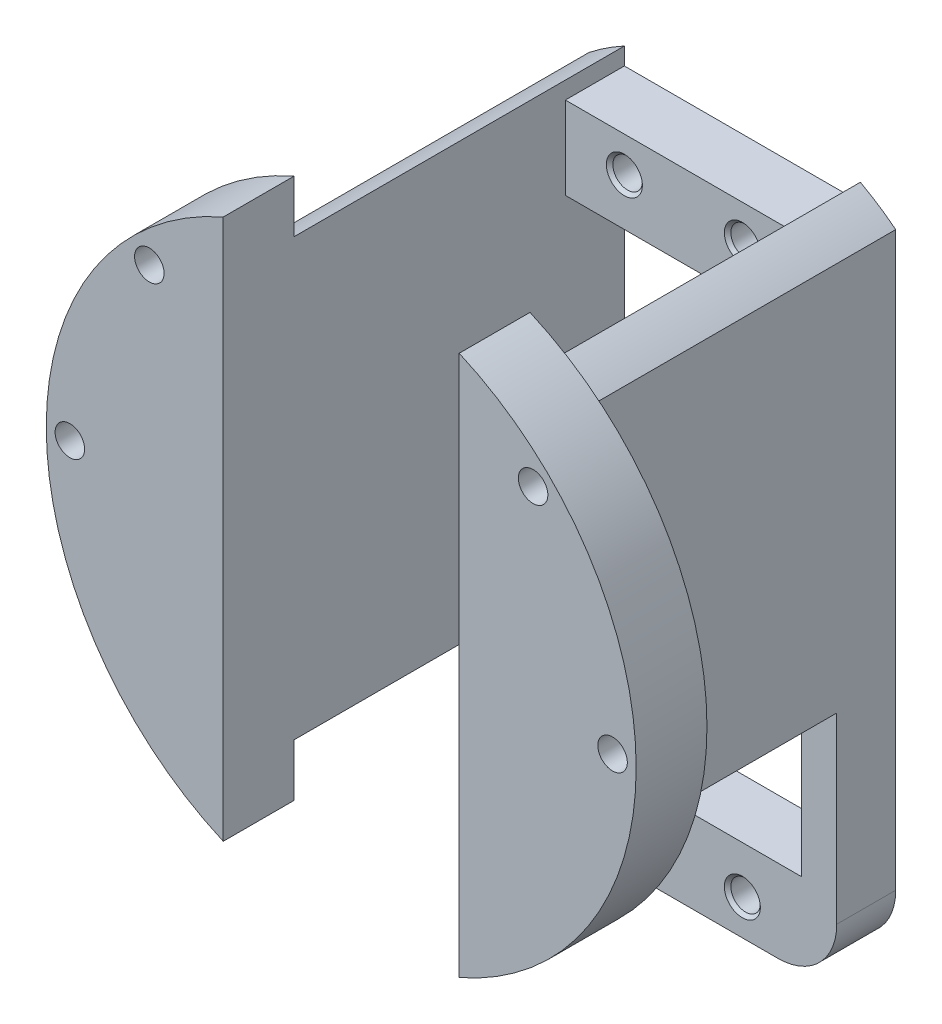
ISO-10303-21;
HEADER;
FILE_DESCRIPTION(('STEP AP214'),'2;1');
FILE_NAME('part.step','',(''),(''),'','','');
FILE_SCHEMA(('AUTOMOTIVE_DESIGN { 1 0 10303 214 1 1 1 1 }'));
ENDSEC;
DATA;
#1=APPLICATION_CONTEXT('core data for automotive mechanical design processes');
#2=APPLICATION_PROTOCOL_DEFINITION('international standard','automotive_design',2000,#1);
#3=PRODUCT_CONTEXT('',#1,'mechanical');
#4=PRODUCT('Part','Part','',(#3));
#5=PRODUCT_RELATED_PRODUCT_CATEGORY('part','',(#4));
#6=PRODUCT_DEFINITION_FORMATION('','',#4);
#7=PRODUCT_DEFINITION_CONTEXT('part definition',#1,'design');
#8=PRODUCT_DEFINITION('design','',#6,#7);
#9=PRODUCT_DEFINITION_SHAPE('','',#8);
#10=(LENGTH_UNIT() NAMED_UNIT(*) SI_UNIT(.MILLI.,.METRE.));
#11=(NAMED_UNIT(*) PLANE_ANGLE_UNIT() SI_UNIT($,.RADIAN.));
#12=(NAMED_UNIT(*) SI_UNIT($,.STERADIAN.) SOLID_ANGLE_UNIT());
#13=UNCERTAINTY_MEASURE_WITH_UNIT(LENGTH_MEASURE(1.E-05),#10,'distance_accuracy_value','');
#14=(GEOMETRIC_REPRESENTATION_CONTEXT(3) GLOBAL_UNCERTAINTY_ASSIGNED_CONTEXT((#13)) GLOBAL_UNIT_ASSIGNED_CONTEXT((#10,
#11,#12)) REPRESENTATION_CONTEXT('',''));
#15=CARTESIAN_POINT('',(0.,0.,0.));
#16=DIRECTION('',(0.,0.,1.));
#17=DIRECTION('',(1.,0.,0.));
#18=AXIS2_PLACEMENT_3D('',#15,#16,#17);
#19=CARTESIAN_POINT('',(0.,0.,0.));
#20=DIRECTION('',(0.,0.,-1.));
#21=DIRECTION('',(-1.,0.,0.));
#22=AXIS2_PLACEMENT_3D('',#19,#20,#21);
#23=PLANE('',#22);
#24=CARTESIAN_POINT('',(5.00000000000001,-34.,0.));
#25=DIRECTION('',(0.,0.,1.));
#26=DIRECTION('',(1.,0.,0.));
#27=AXIS2_PLACEMENT_3D('',#24,#25,#26);
#28=CIRCLE('',#27,1.25);
#29=CARTESIAN_POINT('',(6.25000000000001,-34.,0.));
#30=VERTEX_POINT('',#29);
#31=EDGE_CURVE('E732',#30,#30,#28,.T.);
#32=ORIENTED_EDGE('',*,*,#31,.T.);
#33=EDGE_LOOP('',(#32));
#34=FACE_BOUND('',#33,.T.);
#35=CARTESIAN_POINT('',(5.,14.,0.));
#36=DIRECTION('',(0.,0.,1.));
#37=DIRECTION('',(1.,0.,0.));
#38=AXIS2_PLACEMENT_3D('',#35,#36,#37);
#39=CIRCLE('',#38,1.25);
#40=CARTESIAN_POINT('',(6.25,14.,0.));
#41=VERTEX_POINT('',#40);
#42=EDGE_CURVE('E723',#41,#41,#39,.T.);
#43=ORIENTED_EDGE('',*,*,#42,.T.);
#44=EDGE_LOOP('',(#43));
#45=FACE_BOUND('',#44,.T.);
#46=CARTESIAN_POINT('',(-4.99999999999999,-34.,0.));
#47=DIRECTION('',(0.,0.,1.));
#48=DIRECTION('',(1.,0.,0.));
#49=AXIS2_PLACEMENT_3D('',#46,#47,#48);
#50=CIRCLE('',#49,1.25);
#51=CARTESIAN_POINT('',(-3.74999999999999,-34.,0.));
#52=VERTEX_POINT('',#51);
#53=EDGE_CURVE('E714',#52,#52,#50,.T.);
#54=ORIENTED_EDGE('',*,*,#53,.T.);
#55=EDGE_LOOP('',(#54));
#56=FACE_BOUND('',#55,.T.);
#57=CARTESIAN_POINT('',(-5.,14.,0.));
#58=DIRECTION('',(0.,0.,1.));
#59=DIRECTION('',(1.,0.,0.));
#60=AXIS2_PLACEMENT_3D('',#57,#58,#59);
#61=CIRCLE('',#60,1.25);
#62=CARTESIAN_POINT('',(-3.75,14.,0.));
#63=VERTEX_POINT('',#62);
#64=EDGE_CURVE('E703',#63,#63,#61,.T.);
#65=ORIENTED_EDGE('',*,*,#64,.T.);
#66=EDGE_LOOP('',(#65));
#67=FACE_BOUND('',#66,.T.);
#68=DIRECTION('',(0.,-1.,0.));
#69=VECTOR('',#68,1.);
#70=CARTESIAN_POINT('',(-10.,-30.,0.));
#71=LINE('',#70,#69);
#72=CARTESIAN_POINT('',(-10.,10.,0.));
#73=VERTEX_POINT('',#72);
#74=CARTESIAN_POINT('',(-10.,-30.,0.));
#75=VERTEX_POINT('',#74);
#76=EDGE_CURVE('E302',#73,#75,#71,.T.);
#77=ORIENTED_EDGE('',*,*,#76,.T.);
#78=DIRECTION('',(1.,0.,0.));
#79=VECTOR('',#78,1.);
#80=CARTESIAN_POINT('',(10.,-30.,0.));
#81=LINE('',#80,#79);
#82=CARTESIAN_POINT('',(10.,-30.,0.));
#83=VERTEX_POINT('',#82);
#84=EDGE_CURVE('E316',#75,#83,#81,.T.);
#85=ORIENTED_EDGE('',*,*,#84,.T.);
#86=DIRECTION('',(0.,1.,0.));
#87=VECTOR('',#86,1.);
#88=CARTESIAN_POINT('',(10.,10.,0.));
#89=LINE('',#88,#87);
#90=CARTESIAN_POINT('',(10.,10.,0.));
#91=VERTEX_POINT('',#90);
#92=EDGE_CURVE('E319',#83,#91,#89,.T.);
#93=ORIENTED_EDGE('',*,*,#92,.T.);
#94=DIRECTION('',(-1.,0.,0.));
#95=VECTOR('',#94,1.);
#96=CARTESIAN_POINT('',(-10.,10.,0.));
#97=LINE('',#96,#95);
#98=EDGE_CURVE('E306',#91,#73,#97,.T.);
#99=ORIENTED_EDGE('',*,*,#98,.T.);
#100=EDGE_LOOP('',(#77,#85,#93,#99));
#101=FACE_BOUND('',#100,.T.);
#102=DIRECTION('',(1.,0.,0.));
#103=VECTOR('',#102,1.);
#104=CARTESIAN_POINT('',(13.,-37.,0.));
#105=LINE('',#104,#103);
#106=CARTESIAN_POINT('',(-7.99999999999999,-37.,0.));
#107=VERTEX_POINT('',#106);
#108=CARTESIAN_POINT('',(8.00000000000001,-37.,0.));
#109=VERTEX_POINT('',#108);
#110=EDGE_CURVE('E346',#107,#109,#105,.T.);
#111=ORIENTED_EDGE('',*,*,#110,.F.);
#112=CARTESIAN_POINT('',(-8.,-32.,0.));
#113=DIRECTION('',(0.,0.,-1.));
#114=DIRECTION('',(-1.,0.,0.));
#115=AXIS2_PLACEMENT_3D('',#112,#113,#114);
#116=CIRCLE('',#115,5.);
#117=CARTESIAN_POINT('',(-13.,-32.,0.));
#118=VERTEX_POINT('',#117);
#119=EDGE_CURVE('E358',#107,#118,#116,.T.);
#120=ORIENTED_EDGE('',*,*,#119,.T.);
#121=DIRECTION('',(0.,-1.,0.));
#122=VECTOR('',#121,1.);
#123=CARTESIAN_POINT('',(-13.,-37.,0.));
#124=LINE('',#123,#122);
#125=CARTESIAN_POINT('',(-13.,16.4924225024706,0.));
#126=VERTEX_POINT('',#125);
#127=EDGE_CURVE('E333',#126,#118,#124,.T.);
#128=ORIENTED_EDGE('',*,*,#127,.F.);
#129=CARTESIAN_POINT('',(0.,0.,0.));
#130=DIRECTION('',(0.,0.,1.));
#131=DIRECTION('',(1.,0.,0.));
#132=AXIS2_PLACEMENT_3D('',#129,#130,#131);
#133=CIRCLE('',#132,21.);
#134=CARTESIAN_POINT('',(-10.,18.4661853126194,0.));
#135=VERTEX_POINT('',#134);
#136=EDGE_CURVE('E238',#135,#126,#133,.T.);
#137=ORIENTED_EDGE('',*,*,#136,.F.);
#138=DIRECTION('',(0.,1.,0.));
#139=VECTOR('',#138,1.);
#140=CARTESIAN_POINT('',(-10.,-18.4661853126194,0.));
#141=LINE('',#140,#139);
#142=CARTESIAN_POINT('',(-10.,17.,0.));
#143=VERTEX_POINT('',#142);
#144=EDGE_CURVE('E233',#143,#135,#141,.T.);
#145=ORIENTED_EDGE('',*,*,#144,.F.);
#146=DIRECTION('',(-1.,0.,0.));
#147=VECTOR('',#146,1.);
#148=CARTESIAN_POINT('',(-13.,17.,0.));
#149=LINE('',#148,#147);
#150=CARTESIAN_POINT('',(10.,17.,0.));
#151=VERTEX_POINT('',#150);
#152=EDGE_CURVE('E337',#151,#143,#149,.T.);
#153=ORIENTED_EDGE('',*,*,#152,.F.);
#154=DIRECTION('',(0.,-1.,0.));
#155=VECTOR('',#154,1.);
#156=CARTESIAN_POINT('',(10.,-18.4661853126194,0.));
#157=LINE('',#156,#155);
#158=CARTESIAN_POINT('',(10.,18.4661853126194,0.));
#159=VERTEX_POINT('',#158);
#160=EDGE_CURVE('E272',#159,#151,#157,.T.);
#161=ORIENTED_EDGE('',*,*,#160,.F.);
#162=CARTESIAN_POINT('',(0.,0.,0.));
#163=DIRECTION('',(0.,0.,1.));
#164=DIRECTION('',(1.,0.,0.));
#165=AXIS2_PLACEMENT_3D('',#162,#163,#164);
#166=CIRCLE('',#165,21.);
#167=CARTESIAN_POINT('',(13.,16.4924225024706,0.));
#168=VERTEX_POINT('',#167);
#169=EDGE_CURVE('E267',#168,#159,#166,.T.);
#170=ORIENTED_EDGE('',*,*,#169,.F.);
#171=DIRECTION('',(0.,1.,0.));
#172=VECTOR('',#171,1.);
#173=CARTESIAN_POINT('',(13.,17.,0.));
#174=LINE('',#173,#172);
#175=CARTESIAN_POINT('',(13.,-32.,0.));
#176=VERTEX_POINT('',#175);
#177=EDGE_CURVE('E349',#176,#168,#174,.T.);
#178=ORIENTED_EDGE('',*,*,#177,.F.);
#179=CARTESIAN_POINT('',(8.00000000000001,-32.,0.));
#180=DIRECTION('',(0.,0.,-1.));
#181=DIRECTION('',(-1.,0.,0.));
#182=AXIS2_PLACEMENT_3D('',#179,#180,#181);
#183=CIRCLE('',#182,5.);
#184=EDGE_CURVE('E356',#176,#109,#183,.T.);
#185=ORIENTED_EDGE('',*,*,#184,.T.);
#186=EDGE_LOOP('',(#111,#120,#128,#137,#145,#153,#161,#170,#178,#185));
#187=FACE_BOUND('',#186,.T.);
#188=ADVANCED_FACE('F38',(#34,#45,#56,#67,#101,#187),#23,.T.);
#189=CARTESIAN_POINT('',(13.,17.,5.));
#190=DIRECTION('',(-1.,0.,0.));
#191=DIRECTION('',(0.,-1.,0.));
#192=AXIS2_PLACEMENT_3D('',#189,#190,#191);
#193=PLANE('',#192);
#194=DIRECTION('',(0.,1.,0.));
#195=VECTOR('',#194,1.);
#196=CARTESIAN_POINT('',(13.,17.,5.));
#197=LINE('',#196,#195);
#198=CARTESIAN_POINT('',(13.,-32.,5.));
#199=VERTEX_POINT('',#198);
#200=CARTESIAN_POINT('',(13.,-16.4924225024706,5.));
#201=VERTEX_POINT('',#200);
#202=EDGE_CURVE('E339',#199,#201,#197,.T.);
#203=ORIENTED_EDGE('',*,*,#202,.F.);
#204=DIRECTION('',(0.,0.,-1.));
#205=VECTOR('',#204,1.);
#206=CARTESIAN_POINT('',(13.,-32.,5.));
#207=LINE('',#206,#205);
#208=EDGE_CURVE('E12',#199,#176,#207,.T.);
#209=ORIENTED_EDGE('',*,*,#208,.T.);
#210=ORIENTED_EDGE('',*,*,#177,.T.);
#211=DIRECTION('',(0.,0.,-1.));
#212=VECTOR('',#211,1.);
#213=CARTESIAN_POINT('',(13.,16.4924225024706,28.));
#214=LINE('',#213,#212);
#215=CARTESIAN_POINT('',(13.,16.4924225024706,28.));
#216=VERTEX_POINT('',#215);
#217=EDGE_CURVE('E278',#216,#168,#214,.T.);
#218=ORIENTED_EDGE('',*,*,#217,.F.);
#219=DIRECTION('',(0.,1.,0.));
#220=VECTOR('',#219,1.);
#221=CARTESIAN_POINT('',(13.,16.4924225024706,28.));
#222=LINE('',#221,#220);
#223=CARTESIAN_POINT('',(13.,-16.4924225024706,28.));
#224=VERTEX_POINT('',#223);
#225=EDGE_CURVE('E275',#224,#216,#222,.T.);
#226=ORIENTED_EDGE('',*,*,#225,.F.);
#227=DIRECTION('',(0.,0.,-1.));
#228=VECTOR('',#227,1.);
#229=CARTESIAN_POINT('',(13.,-16.4924225024706,28.));
#230=LINE('',#229,#228);
#231=EDGE_CURVE('E284',#224,#201,#230,.T.);
#232=ORIENTED_EDGE('',*,*,#231,.T.);
#233=EDGE_LOOP('',(#203,#209,#210,#218,#226,#232));
#234=FACE_BOUND('',#233,.T.);
#235=ADVANCED_FACE('F400',(#234),#193,.F.);
#236=CARTESIAN_POINT('',(0.,0.,5.));
#237=DIRECTION('',(0.,0.,-1.));
#238=DIRECTION('',(-1.,0.,0.));
#239=AXIS2_PLACEMENT_3D('',#236,#237,#238);
#240=PLANE('',#239);
#241=CARTESIAN_POINT('',(5.00000000000001,-34.,5.));
#242=DIRECTION('',(0.,0.,1.));
#243=DIRECTION('',(1.,0.,0.));
#244=AXIS2_PLACEMENT_3D('',#241,#242,#243);
#245=CIRCLE('',#244,1.525);
#246=CARTESIAN_POINT('',(6.52500000000001,-34.,5.));
#247=VERTEX_POINT('',#246);
#248=EDGE_CURVE('E737',#247,#247,#245,.T.);
#249=ORIENTED_EDGE('',*,*,#248,.F.);
#250=EDGE_LOOP('',(#249));
#251=FACE_BOUND('',#250,.T.);
#252=CARTESIAN_POINT('',(-4.99999999999999,-34.,5.));
#253=DIRECTION('',(0.,0.,1.));
#254=DIRECTION('',(1.,0.,0.));
#255=AXIS2_PLACEMENT_3D('',#252,#253,#254);
#256=CIRCLE('',#255,1.525);
#257=CARTESIAN_POINT('',(-3.47499999999999,-34.,5.));
#258=VERTEX_POINT('',#257);
#259=EDGE_CURVE('E720',#258,#258,#256,.T.);
#260=ORIENTED_EDGE('',*,*,#259,.F.);
#261=EDGE_LOOP('',(#260));
#262=FACE_BOUND('',#261,.T.);
#263=DIRECTION('',(0.,-1.,0.));
#264=VECTOR('',#263,1.);
#265=CARTESIAN_POINT('',(-13.,-37.,5.));
#266=LINE('',#265,#264);
#267=CARTESIAN_POINT('',(-13.,-16.4924225024706,5.));
#268=VERTEX_POINT('',#267);
#269=CARTESIAN_POINT('',(-13.,-32.,5.));
#270=VERTEX_POINT('',#269);
#271=EDGE_CURVE('E334',#268,#270,#266,.T.);
#272=ORIENTED_EDGE('',*,*,#271,.T.);
#273=CARTESIAN_POINT('',(-8.,-32.,5.));
#274=DIRECTION('',(0.,0.,-1.));
#275=DIRECTION('',(-1.,0.,0.));
#276=AXIS2_PLACEMENT_3D('',#273,#274,#275);
#277=CIRCLE('',#276,5.);
#278=CARTESIAN_POINT('',(-7.99999999999999,-37.,5.));
#279=VERTEX_POINT('',#278);
#280=EDGE_CURVE('E46',#270,#279,#277,.F.);
#281=ORIENTED_EDGE('',*,*,#280,.T.);
#282=DIRECTION('',(1.,0.,0.));
#283=VECTOR('',#282,1.);
#284=CARTESIAN_POINT('',(13.,-37.,5.));
#285=LINE('',#284,#283);
#286=CARTESIAN_POINT('',(8.00000000000001,-37.,5.));
#287=VERTEX_POINT('',#286);
#288=EDGE_CURVE('E336',#279,#287,#285,.T.);
#289=ORIENTED_EDGE('',*,*,#288,.T.);
#290=CARTESIAN_POINT('',(8.00000000000001,-32.,5.));
#291=DIRECTION('',(0.,0.,-1.));
#292=DIRECTION('',(-1.,0.,0.));
#293=AXIS2_PLACEMENT_3D('',#290,#291,#292);
#294=CIRCLE('',#293,5.);
#295=EDGE_CURVE('E53',#287,#199,#294,.F.);
#296=ORIENTED_EDGE('',*,*,#295,.T.);
#297=ORIENTED_EDGE('',*,*,#202,.T.);
#298=CARTESIAN_POINT('',(0.,0.,5.));
#299=DIRECTION('',(0.,0.,-1.));
#300=DIRECTION('',(-1.,0.,0.));
#301=AXIS2_PLACEMENT_3D('',#298,#299,#300);
#302=CIRCLE('',#301,21.);
#303=CARTESIAN_POINT('',(10.,-18.4661853126194,5.));
#304=VERTEX_POINT('',#303);
#305=EDGE_CURVE('E297',#304,#201,#302,.F.);
#306=ORIENTED_EDGE('',*,*,#305,.F.);
#307=DIRECTION('',(0.,1.,0.));
#308=VECTOR('',#307,1.);
#309=CARTESIAN_POINT('',(10.,10.,5.));
#310=LINE('',#309,#308);
#311=CARTESIAN_POINT('',(10.,-30.,5.));
#312=VERTEX_POINT('',#311);
#313=EDGE_CURVE('E308',#312,#304,#310,.T.);
#314=ORIENTED_EDGE('',*,*,#313,.F.);
#315=DIRECTION('',(1.,0.,0.));
#316=VECTOR('',#315,1.);
#317=CARTESIAN_POINT('',(10.,-30.,5.));
#318=LINE('',#317,#316);
#319=CARTESIAN_POINT('',(-10.,-30.,5.));
#320=VERTEX_POINT('',#319);
#321=EDGE_CURVE('E305',#320,#312,#318,.T.);
#322=ORIENTED_EDGE('',*,*,#321,.F.);
#323=DIRECTION('',(0.,-1.,0.));
#324=VECTOR('',#323,1.);
#325=CARTESIAN_POINT('',(-10.,-30.,5.));
#326=LINE('',#325,#324);
#327=CARTESIAN_POINT('',(-10.,-18.4661853126194,5.));
#328=VERTEX_POINT('',#327);
#329=EDGE_CURVE('E303',#328,#320,#326,.T.);
#330=ORIENTED_EDGE('',*,*,#329,.F.);
#331=CARTESIAN_POINT('',(0.,0.,5.));
#332=DIRECTION('',(0.,0.,-1.));
#333=DIRECTION('',(-1.,0.,0.));
#334=AXIS2_PLACEMENT_3D('',#331,#332,#333);
#335=CIRCLE('',#334,21.);
#336=EDGE_CURVE('E264',#268,#328,#335,.F.);
#337=ORIENTED_EDGE('',*,*,#336,.F.);
#338=EDGE_LOOP('',(#272,#281,#289,#296,#297,#306,#314,#322,#330,#337));
#339=FACE_BOUND('',#338,.T.);
#340=ADVANCED_FACE('F363',(#251,#262,#339),#240,.F.);
#341=CARTESIAN_POINT('',(5.,14.,5.));
#342=DIRECTION('',(0.,0.,1.));
#343=DIRECTION('',(1.,0.,0.));
#344=AXIS2_PLACEMENT_3D('',#341,#342,#343);
#345=CIRCLE('',#344,1.525);
#346=CARTESIAN_POINT('',(6.525,14.,5.));
#347=VERTEX_POINT('',#346);
#348=EDGE_CURVE('E729',#347,#347,#345,.T.);
#349=ORIENTED_EDGE('',*,*,#348,.F.);
#350=EDGE_LOOP('',(#349));
#351=FACE_BOUND('',#350,.T.);
#352=CARTESIAN_POINT('',(-5.,14.,5.));
#353=DIRECTION('',(0.,0.,1.));
#354=DIRECTION('',(1.,0.,0.));
#355=AXIS2_PLACEMENT_3D('',#352,#353,#354);
#356=CIRCLE('',#355,1.525);
#357=CARTESIAN_POINT('',(-3.475,14.,5.));
#358=VERTEX_POINT('',#357);
#359=EDGE_CURVE('E711',#358,#358,#356,.T.);
#360=ORIENTED_EDGE('',*,*,#359,.F.);
#361=EDGE_LOOP('',(#360));
#362=FACE_BOUND('',#361,.T.);
#363=DIRECTION('',(0.,1.,0.));
#364=VECTOR('',#363,1.);
#365=CARTESIAN_POINT('',(-10.,0.,5.));
#366=LINE('',#365,#364);
#367=CARTESIAN_POINT('',(-10.,10.,5.));
#368=VERTEX_POINT('',#367);
#369=CARTESIAN_POINT('',(-10.,17.,5.));
#370=VERTEX_POINT('',#369);
#371=EDGE_CURVE('E258',#368,#370,#366,.T.);
#372=ORIENTED_EDGE('',*,*,#371,.F.);
#373=DIRECTION('',(-1.,0.,0.));
#374=VECTOR('',#373,1.);
#375=CARTESIAN_POINT('',(-10.,10.,5.));
#376=LINE('',#375,#374);
#377=CARTESIAN_POINT('',(10.,10.,5.));
#378=VERTEX_POINT('',#377);
#379=EDGE_CURVE('E311',#378,#368,#376,.T.);
#380=ORIENTED_EDGE('',*,*,#379,.F.);
#381=DIRECTION('',(0.,-1.,0.));
#382=VECTOR('',#381,1.);
#383=CARTESIAN_POINT('',(10.,0.,5.));
#384=LINE('',#383,#382);
#385=CARTESIAN_POINT('',(10.,17.,5.));
#386=VERTEX_POINT('',#385);
#387=EDGE_CURVE('E294',#386,#378,#384,.T.);
#388=ORIENTED_EDGE('',*,*,#387,.F.);
#389=DIRECTION('',(-1.,0.,0.));
#390=VECTOR('',#389,1.);
#391=CARTESIAN_POINT('',(-13.,17.,5.));
#392=LINE('',#391,#390);
#393=EDGE_CURVE('E341',#386,#370,#392,.T.);
#394=ORIENTED_EDGE('',*,*,#393,.T.);
#395=EDGE_LOOP('',(#372,#380,#388,#394));
#396=FACE_BOUND('',#395,.T.);
#397=ADVANCED_FACE('F387',(#351,#362,#396),#240,.F.);
#398=CARTESIAN_POINT('',(-13.,17.,5.));
#399=DIRECTION('',(0.,-1.,0.));
#400=DIRECTION('',(0.,0.,-1.));
#401=AXIS2_PLACEMENT_3D('',#398,#399,#400);
#402=PLANE('',#401);
#403=DIRECTION('',(0.,0.,-1.));
#404=VECTOR('',#403,1.);
#405=CARTESIAN_POINT('',(-10.,17.,5.));
#406=LINE('',#405,#404);
#407=EDGE_CURVE('E261',#370,#143,#406,.T.);
#408=ORIENTED_EDGE('',*,*,#407,.F.);
#409=ORIENTED_EDGE('',*,*,#393,.F.);
#410=DIRECTION('',(0.,0.,1.));
#411=VECTOR('',#410,1.);
#412=CARTESIAN_POINT('',(10.,17.,5.));
#413=LINE('',#412,#411);
#414=EDGE_CURVE('E293',#151,#386,#413,.T.);
#415=ORIENTED_EDGE('',*,*,#414,.F.);
#416=ORIENTED_EDGE('',*,*,#152,.T.);
#417=EDGE_LOOP('',(#408,#409,#415,#416));
#418=FACE_BOUND('',#417,.T.);
#419=ADVANCED_FACE('F385',(#418),#402,.F.);
#420=CARTESIAN_POINT('',(-13.,-37.,5.));
#421=DIRECTION('',(1.,0.,0.));
#422=DIRECTION('',(0.,0.,-1.));
#423=AXIS2_PLACEMENT_3D('',#420,#421,#422);
#424=PLANE('',#423);
#425=ORIENTED_EDGE('',*,*,#127,.T.);
#426=DIRECTION('',(0.,0.,-1.));
#427=VECTOR('',#426,1.);
#428=CARTESIAN_POINT('',(-13.,-32.,5.));
#429=LINE('',#428,#427);
#430=EDGE_CURVE('E61',#118,#270,#429,.F.);
#431=ORIENTED_EDGE('',*,*,#430,.T.);
#432=ORIENTED_EDGE('',*,*,#271,.F.);
#433=DIRECTION('',(0.,0.,-1.));
#434=VECTOR('',#433,1.);
#435=CARTESIAN_POINT('',(-13.,-16.4924225024706,28.));
#436=LINE('',#435,#434);
#437=CARTESIAN_POINT('',(-13.,-16.4924225024706,28.));
#438=VERTEX_POINT('',#437);
#439=EDGE_CURVE('E244',#438,#268,#436,.T.);
#440=ORIENTED_EDGE('',*,*,#439,.F.);
#441=DIRECTION('',(0.,-1.,0.));
#442=VECTOR('',#441,1.);
#443=CARTESIAN_POINT('',(-13.,-16.4924225024706,28.));
#444=LINE('',#443,#442);
#445=CARTESIAN_POINT('',(-13.,16.4924225024706,28.));
#446=VERTEX_POINT('',#445);
#447=EDGE_CURVE('E241',#446,#438,#444,.T.);
#448=ORIENTED_EDGE('',*,*,#447,.F.);
#449=DIRECTION('',(0.,0.,-1.));
#450=VECTOR('',#449,1.);
#451=CARTESIAN_POINT('',(-13.,16.4924225024706,28.));
#452=LINE('',#451,#450);
#453=EDGE_CURVE('E250',#446,#126,#452,.T.);
#454=ORIENTED_EDGE('',*,*,#453,.T.);
#455=EDGE_LOOP('',(#425,#431,#432,#440,#448,#454));
#456=FACE_BOUND('',#455,.T.);
#457=ADVANCED_FACE('F374',(#456),#424,.F.);
#458=CARTESIAN_POINT('',(13.,-37.,5.));
#459=DIRECTION('',(0.,1.,0.));
#460=DIRECTION('',(0.,0.,1.));
#461=AXIS2_PLACEMENT_3D('',#458,#459,#460);
#462=PLANE('',#461);
#463=ORIENTED_EDGE('',*,*,#288,.F.);
#464=DIRECTION('',(0.,0.,-1.));
#465=VECTOR('',#464,1.);
#466=CARTESIAN_POINT('',(-8.,-37.,5.));
#467=LINE('',#466,#465);
#468=EDGE_CURVE('E353',#279,#107,#467,.T.);
#469=ORIENTED_EDGE('',*,*,#468,.T.);
#470=ORIENTED_EDGE('',*,*,#110,.T.);
#471=DIRECTION('',(0.,0.,-1.));
#472=VECTOR('',#471,1.);
#473=CARTESIAN_POINT('',(8.00000000000001,-37.,5.));
#474=LINE('',#473,#472);
#475=EDGE_CURVE('E344',#109,#287,#474,.F.);
#476=ORIENTED_EDGE('',*,*,#475,.T.);
#477=EDGE_LOOP('',(#463,#469,#470,#476));
#478=FACE_BOUND('',#477,.T.);
#479=ADVANCED_FACE('F367',(#478),#462,.F.);
#480=CARTESIAN_POINT('',(-10.,-30.,5.));
#481=DIRECTION('',(1.,0.,0.));
#482=DIRECTION('',(0.,1.,0.));
#483=AXIS2_PLACEMENT_3D('',#480,#481,#482);
#484=PLANE('',#483);
#485=DIRECTION('',(0.,0.,-1.));
#486=VECTOR('',#485,1.);
#487=CARTESIAN_POINT('',(-10.,10.,5.));
#488=LINE('',#487,#486);
#489=EDGE_CURVE('E314',#368,#73,#488,.T.);
#490=ORIENTED_EDGE('',*,*,#489,.F.);
#491=ORIENTED_EDGE('',*,*,#371,.T.);
#492=ORIENTED_EDGE('',*,*,#407,.T.);
#493=ORIENTED_EDGE('',*,*,#144,.T.);
#494=DIRECTION('',(0.,0.,-1.));
#495=VECTOR('',#494,1.);
#496=CARTESIAN_POINT('',(-10.,18.4661853126194,28.));
#497=LINE('',#496,#495);
#498=CARTESIAN_POINT('',(-10.,18.4661853126194,28.));
#499=VERTEX_POINT('',#498);
#500=EDGE_CURVE('E252',#499,#135,#497,.T.);
#501=ORIENTED_EDGE('',*,*,#500,.F.);
#502=DIRECTION('',(0.,1.,0.));
#503=VECTOR('',#502,1.);
#504=CARTESIAN_POINT('',(-10.,-22.9128784747792,28.));
#505=LINE('',#504,#503);
#506=CARTESIAN_POINT('',(-10.,22.9128784747792,28.));
#507=VERTEX_POINT('',#506);
#508=EDGE_CURVE('E702',#499,#507,#505,.T.);
#509=ORIENTED_EDGE('',*,*,#508,.T.);
#510=DIRECTION('',(0.,0.,-1.));
#511=VECTOR('',#510,1.);
#512=CARTESIAN_POINT('',(-10.,22.9128784747792,34.));
#513=LINE('',#512,#511);
#514=CARTESIAN_POINT('',(-10.,22.9128784747792,34.));
#515=VERTEX_POINT('',#514);
#516=EDGE_CURVE('E199',#515,#507,#513,.T.);
#517=ORIENTED_EDGE('',*,*,#516,.F.);
#518=DIRECTION('',(0.,1.,0.));
#519=VECTOR('',#518,1.);
#520=CARTESIAN_POINT('',(-10.,-22.9128784747792,34.));
#521=LINE('',#520,#519);
#522=CARTESIAN_POINT('',(-10.,-22.9128784747792,34.));
#523=VERTEX_POINT('',#522);
#524=EDGE_CURVE('E190',#523,#515,#521,.T.);
#525=ORIENTED_EDGE('',*,*,#524,.F.);
#526=DIRECTION('',(0.,0.,-1.));
#527=VECTOR('',#526,1.);
#528=CARTESIAN_POINT('',(-10.,-22.9128784747792,34.));
#529=LINE('',#528,#527);
#530=CARTESIAN_POINT('',(-10.,-22.9128784747792,28.));
#531=VERTEX_POINT('',#530);
#532=EDGE_CURVE('E196',#523,#531,#529,.T.);
#533=ORIENTED_EDGE('',*,*,#532,.T.);
#534=CARTESIAN_POINT('',(-10.,-18.4661853126194,28.));
#535=VERTEX_POINT('',#534);
#536=EDGE_CURVE('E206',#531,#535,#505,.T.);
#537=ORIENTED_EDGE('',*,*,#536,.T.);
#538=DIRECTION('',(0.,0.,-1.));
#539=VECTOR('',#538,1.);
#540=CARTESIAN_POINT('',(-10.,-18.4661853126194,28.));
#541=LINE('',#540,#539);
#542=EDGE_CURVE('E255',#535,#328,#541,.T.);
#543=ORIENTED_EDGE('',*,*,#542,.T.);
#544=ORIENTED_EDGE('',*,*,#329,.T.);
#545=DIRECTION('',(0.,0.,-1.));
#546=VECTOR('',#545,1.);
#547=CARTESIAN_POINT('',(-10.,-30.,5.));
#548=LINE('',#547,#546);
#549=EDGE_CURVE('E330',#320,#75,#548,.T.);
#550=ORIENTED_EDGE('',*,*,#549,.T.);
#551=ORIENTED_EDGE('',*,*,#76,.F.);
#552=EDGE_LOOP('',(#490,#491,#492,#493,#501,#509,#517,#525,#533,#537,#543,#544,#550,#551));
#553=FACE_BOUND('',#552,.T.);
#554=ADVANCED_FACE('F193',(#553),#484,.T.);
#555=CARTESIAN_POINT('',(10.,-30.,5.));
#556=DIRECTION('',(0.,1.,0.));
#557=DIRECTION('',(0.,0.,1.));
#558=AXIS2_PLACEMENT_3D('',#555,#556,#557);
#559=PLANE('',#558);
#560=ORIENTED_EDGE('',*,*,#84,.F.);
#561=ORIENTED_EDGE('',*,*,#549,.F.);
#562=ORIENTED_EDGE('',*,*,#321,.T.);
#563=DIRECTION('',(0.,0.,-1.));
#564=VECTOR('',#563,1.);
#565=CARTESIAN_POINT('',(10.,-30.,5.));
#566=LINE('',#565,#564);
#567=EDGE_CURVE('E328',#312,#83,#566,.T.);
#568=ORIENTED_EDGE('',*,*,#567,.T.);
#569=EDGE_LOOP('',(#560,#561,#562,#568));
#570=FACE_BOUND('',#569,.T.);
#571=ADVANCED_FACE('F454',(#570),#559,.T.);
#572=CARTESIAN_POINT('',(10.,10.,5.));
#573=DIRECTION('',(-1.,0.,0.));
#574=DIRECTION('',(0.,-1.,0.));
#575=AXIS2_PLACEMENT_3D('',#572,#573,#574);
#576=PLANE('',#575);
#577=DIRECTION('',(0.,0.,-1.));
#578=VECTOR('',#577,1.);
#579=CARTESIAN_POINT('',(10.,10.,5.));
#580=LINE('',#579,#578);
#581=EDGE_CURVE('E325',#378,#91,#580,.T.);
#582=ORIENTED_EDGE('',*,*,#581,.T.);
#583=ORIENTED_EDGE('',*,*,#92,.F.);
#584=ORIENTED_EDGE('',*,*,#567,.F.);
#585=ORIENTED_EDGE('',*,*,#313,.T.);
#586=DIRECTION('',(0.,0.,-1.));
#587=VECTOR('',#586,1.);
#588=CARTESIAN_POINT('',(10.,-18.4661853126194,28.));
#589=LINE('',#588,#587);
#590=CARTESIAN_POINT('',(10.,-18.4661853126194,28.));
#591=VERTEX_POINT('',#590);
#592=EDGE_CURVE('E287',#591,#304,#589,.T.);
#593=ORIENTED_EDGE('',*,*,#592,.F.);
#594=DIRECTION('',(0.,-1.,0.));
#595=VECTOR('',#594,1.);
#596=CARTESIAN_POINT('',(10.,-22.9128784747792,28.));
#597=LINE('',#596,#595);
#598=CARTESIAN_POINT('',(10.,-22.9128784747792,28.));
#599=VERTEX_POINT('',#598);
#600=EDGE_CURVE('E214',#591,#599,#597,.T.);
#601=ORIENTED_EDGE('',*,*,#600,.T.);
#602=DIRECTION('',(0.,0.,-1.));
#603=VECTOR('',#602,1.);
#604=CARTESIAN_POINT('',(10.,-22.9128784747792,34.));
#605=LINE('',#604,#603);
#606=CARTESIAN_POINT('',(10.,-22.9128784747792,34.));
#607=VERTEX_POINT('',#606);
#608=EDGE_CURVE('E224',#607,#599,#605,.T.);
#609=ORIENTED_EDGE('',*,*,#608,.F.);
#610=DIRECTION('',(0.,-1.,0.));
#611=VECTOR('',#610,1.);
#612=CARTESIAN_POINT('',(10.,-22.9128784747792,34.));
#613=LINE('',#612,#611);
#614=CARTESIAN_POINT('',(10.,22.9128784747792,34.));
#615=VERTEX_POINT('',#614);
#616=EDGE_CURVE('E222',#615,#607,#613,.T.);
#617=ORIENTED_EDGE('',*,*,#616,.F.);
#618=DIRECTION('',(0.,0.,-1.));
#619=VECTOR('',#618,1.);
#620=CARTESIAN_POINT('',(10.,22.9128784747792,34.));
#621=LINE('',#620,#619);
#622=CARTESIAN_POINT('',(10.,22.9128784747792,28.));
#623=VERTEX_POINT('',#622);
#624=EDGE_CURVE('E230',#615,#623,#621,.T.);
#625=ORIENTED_EDGE('',*,*,#624,.T.);
#626=CARTESIAN_POINT('',(10.,18.4661853126194,28.));
#627=VERTEX_POINT('',#626);
#628=EDGE_CURVE('E223',#623,#627,#597,.T.);
#629=ORIENTED_EDGE('',*,*,#628,.T.);
#630=DIRECTION('',(0.,0.,-1.));
#631=VECTOR('',#630,1.);
#632=CARTESIAN_POINT('',(10.,18.4661853126194,28.));
#633=LINE('',#632,#631);
#634=EDGE_CURVE('E290',#627,#159,#633,.T.);
#635=ORIENTED_EDGE('',*,*,#634,.T.);
#636=ORIENTED_EDGE('',*,*,#160,.T.);
#637=ORIENTED_EDGE('',*,*,#414,.T.);
#638=ORIENTED_EDGE('',*,*,#387,.T.);
#639=EDGE_LOOP('',(#582,#583,#584,#585,#593,#601,#609,#617,#625,#629,#635,#636,#637,#638));
#640=FACE_BOUND('',#639,.T.);
#641=ADVANCED_FACE('F390',(#640),#576,.T.);
#642=CARTESIAN_POINT('',(-10.,10.,5.));
#643=DIRECTION('',(0.,-1.,0.));
#644=DIRECTION('',(0.,0.,-1.));
#645=AXIS2_PLACEMENT_3D('',#642,#643,#644);
#646=PLANE('',#645);
#647=ORIENTED_EDGE('',*,*,#98,.F.);
#648=ORIENTED_EDGE('',*,*,#581,.F.);
#649=ORIENTED_EDGE('',*,*,#379,.T.);
#650=ORIENTED_EDGE('',*,*,#489,.T.);
#651=EDGE_LOOP('',(#647,#648,#649,#650));
#652=FACE_BOUND('',#651,.T.);
#653=ADVANCED_FACE('F467',(#652),#646,.T.);
#654=CARTESIAN_POINT('',(0.,0.,28.));
#655=DIRECTION('',(0.,0.,-1.));
#656=DIRECTION('',(-1.,0.,0.));
#657=AXIS2_PLACEMENT_3D('',#654,#655,#656);
#658=CYLINDRICAL_SURFACE('',#657,21.);
#659=ORIENTED_EDGE('',*,*,#217,.T.);
#660=ORIENTED_EDGE('',*,*,#169,.T.);
#661=ORIENTED_EDGE('',*,*,#634,.F.);
#662=CARTESIAN_POINT('',(0.,0.,28.));
#663=DIRECTION('',(0.,0.,1.));
#664=DIRECTION('',(1.,0.,0.));
#665=AXIS2_PLACEMENT_3D('',#662,#663,#664);
#666=CIRCLE('',#665,21.);
#667=EDGE_CURVE('E268',#216,#627,#666,.T.);
#668=ORIENTED_EDGE('',*,*,#667,.F.);
#669=EDGE_LOOP('',(#659,#660,#661,#668));
#670=FACE_BOUND('',#669,.T.);
#671=ADVANCED_FACE('F396',(#670),#658,.T.);
#672=CARTESIAN_POINT('',(0.,0.,28.));
#673=DIRECTION('',(0.,0.,-1.));
#674=DIRECTION('',(-1.,0.,0.));
#675=AXIS2_PLACEMENT_3D('',#672,#673,#674);
#676=CYLINDRICAL_SURFACE('',#675,21.);
#677=ORIENTED_EDGE('',*,*,#592,.T.);
#678=ORIENTED_EDGE('',*,*,#305,.T.);
#679=ORIENTED_EDGE('',*,*,#231,.F.);
#680=CARTESIAN_POINT('',(0.,0.,28.));
#681=DIRECTION('',(0.,0.,1.));
#682=DIRECTION('',(1.,0.,0.));
#683=AXIS2_PLACEMENT_3D('',#680,#681,#682);
#684=CIRCLE('',#683,21.);
#685=EDGE_CURVE('E271',#591,#224,#684,.T.);
#686=ORIENTED_EDGE('',*,*,#685,.F.);
#687=EDGE_LOOP('',(#677,#678,#679,#686));
#688=FACE_BOUND('',#687,.T.);
#689=ADVANCED_FACE('F407',(#688),#676,.T.);
#690=CARTESIAN_POINT('',(0.,0.,28.));
#691=DIRECTION('',(0.,0.,-1.));
#692=DIRECTION('',(-1.,0.,0.));
#693=AXIS2_PLACEMENT_3D('',#690,#691,#692);
#694=CYLINDRICAL_SURFACE('',#693,21.);
#695=ORIENTED_EDGE('',*,*,#136,.T.);
#696=ORIENTED_EDGE('',*,*,#453,.F.);
#697=CARTESIAN_POINT('',(0.,0.,28.));
#698=DIRECTION('',(0.,0.,1.));
#699=DIRECTION('',(1.,0.,0.));
#700=AXIS2_PLACEMENT_3D('',#697,#698,#699);
#701=CIRCLE('',#700,21.);
#702=EDGE_CURVE('E237',#499,#446,#701,.T.);
#703=ORIENTED_EDGE('',*,*,#702,.F.);
#704=ORIENTED_EDGE('',*,*,#500,.T.);
#705=EDGE_LOOP('',(#695,#696,#703,#704));
#706=FACE_BOUND('',#705,.T.);
#707=ADVANCED_FACE('F379',(#706),#694,.T.);
#708=CARTESIAN_POINT('',(0.,0.,28.));
#709=DIRECTION('',(0.,0.,-1.));
#710=DIRECTION('',(-1.,0.,0.));
#711=AXIS2_PLACEMENT_3D('',#708,#709,#710);
#712=CYLINDRICAL_SURFACE('',#711,21.);
#713=ORIENTED_EDGE('',*,*,#439,.T.);
#714=ORIENTED_EDGE('',*,*,#336,.T.);
#715=ORIENTED_EDGE('',*,*,#542,.F.);
#716=CARTESIAN_POINT('',(0.,0.,28.));
#717=DIRECTION('',(0.,0.,1.));
#718=DIRECTION('',(1.,0.,0.));
#719=AXIS2_PLACEMENT_3D('',#716,#717,#718);
#720=CIRCLE('',#719,21.);
#721=EDGE_CURVE('E234',#438,#535,#720,.T.);
#722=ORIENTED_EDGE('',*,*,#721,.F.);
#723=EDGE_LOOP('',(#713,#714,#715,#722));
#724=FACE_BOUND('',#723,.T.);
#725=ADVANCED_FACE('F418',(#724),#712,.T.);
#726=CARTESIAN_POINT('',(-8.,-32.,5.));
#727=DIRECTION('',(0.,0.,-1.));
#728=DIRECTION('',(-1.,0.,0.));
#729=AXIS2_PLACEMENT_3D('',#726,#727,#728);
#730=CYLINDRICAL_SURFACE('',#729,5.);
#731=ORIENTED_EDGE('',*,*,#280,.F.);
#732=ORIENTED_EDGE('',*,*,#430,.F.);
#733=ORIENTED_EDGE('',*,*,#119,.F.);
#734=ORIENTED_EDGE('',*,*,#468,.F.);
#735=EDGE_LOOP('',(#731,#732,#733,#734));
#736=FACE_BOUND('',#735,.T.);
#737=ADVANCED_FACE('F370',(#736),#730,.T.);
#738=CARTESIAN_POINT('',(8.00000000000001,-32.,5.));
#739=DIRECTION('',(0.,0.,-1.));
#740=DIRECTION('',(-1.,0.,0.));
#741=AXIS2_PLACEMENT_3D('',#738,#739,#740);
#742=CYLINDRICAL_SURFACE('',#741,5.);
#743=ORIENTED_EDGE('',*,*,#295,.F.);
#744=ORIENTED_EDGE('',*,*,#475,.F.);
#745=ORIENTED_EDGE('',*,*,#184,.F.);
#746=ORIENTED_EDGE('',*,*,#208,.F.);
#747=EDGE_LOOP('',(#743,#744,#745,#746));
#748=FACE_BOUND('',#747,.T.);
#749=ADVANCED_FACE('F40',(#748),#742,.T.);
#750=CARTESIAN_POINT('',(0.,0.,28.));
#751=DIRECTION('',(0.,0.,1.));
#752=DIRECTION('',(1.,0.,0.));
#753=AXIS2_PLACEMENT_3D('',#750,#751,#752);
#754=PLANE('',#753);
#755=CARTESIAN_POINT('',(23.,0.,28.));
#756=DIRECTION('',(0.,0.,1.));
#757=DIRECTION('',(-1.,0.,0.));
#758=AXIS2_PLACEMENT_3D('',#755,#756,#757);
#759=CIRCLE('',#758,1.25000000000001);
#760=CARTESIAN_POINT('',(21.75,0.,28.));
#761=VERTEX_POINT('',#760);
#762=EDGE_CURVE('E746',#761,#761,#759,.T.);
#763=ORIENTED_EDGE('',*,*,#762,.T.);
#764=EDGE_LOOP('',(#763));
#765=FACE_BOUND('',#764,.T.);
#766=CARTESIAN_POINT('',(16.2634559672905,16.2634559672907,28.));
#767=DIRECTION('',(0.,0.,1.));
#768=DIRECTION('',(-0.707106781186541,-0.707106781186554,0.));
#769=AXIS2_PLACEMENT_3D('',#766,#767,#768);
#770=CIRCLE('',#769,1.25000000000001);
#771=CARTESIAN_POINT('',(15.3795724908073,15.3795724908075,28.));
#772=VERTEX_POINT('',#771);
#773=EDGE_CURVE('E754',#772,#772,#770,.T.);
#774=ORIENTED_EDGE('',*,*,#773,.T.);
#775=EDGE_LOOP('',(#774));
#776=FACE_BOUND('',#775,.T.);
#777=ORIENTED_EDGE('',*,*,#225,.T.);
#778=ORIENTED_EDGE('',*,*,#667,.T.);
#779=ORIENTED_EDGE('',*,*,#628,.F.);
#780=CARTESIAN_POINT('',(0.,0.,28.));
#781=DIRECTION('',(0.,0.,1.));
#782=DIRECTION('',(1.,0.,0.));
#783=AXIS2_PLACEMENT_3D('',#780,#781,#782);
#784=CIRCLE('',#783,25.);
#785=EDGE_CURVE('E211',#599,#623,#784,.T.);
#786=ORIENTED_EDGE('',*,*,#785,.F.);
#787=ORIENTED_EDGE('',*,*,#600,.F.);
#788=ORIENTED_EDGE('',*,*,#685,.T.);
#789=EDGE_LOOP('',(#777,#778,#779,#786,#787,#788));
#790=FACE_BOUND('',#789,.T.);
#791=ADVANCED_FACE('F402',(#765,#776,#790),#754,.F.);
#792=CARTESIAN_POINT('',(0.,0.,34.));
#793=DIRECTION('',(0.,0.,-1.));
#794=DIRECTION('',(-1.,0.,0.));
#795=AXIS2_PLACEMENT_3D('',#792,#793,#794);
#796=CYLINDRICAL_SURFACE('',#795,25.);
#797=ORIENTED_EDGE('',*,*,#785,.T.);
#798=ORIENTED_EDGE('',*,*,#624,.F.);
#799=CARTESIAN_POINT('',(0.,0.,34.));
#800=DIRECTION('',(0.,0.,1.));
#801=DIRECTION('',(1.,0.,0.));
#802=AXIS2_PLACEMENT_3D('',#799,#800,#801);
#803=CIRCLE('',#802,25.);
#804=EDGE_CURVE('E219',#607,#615,#803,.T.);
#805=ORIENTED_EDGE('',*,*,#804,.F.);
#806=ORIENTED_EDGE('',*,*,#608,.T.);
#807=EDGE_LOOP('',(#797,#798,#805,#806));
#808=FACE_BOUND('',#807,.T.);
#809=ADVANCED_FACE('F415',(#808),#796,.T.);
#810=CARTESIAN_POINT('',(0.,0.,34.));
#811=DIRECTION('',(0.,0.,1.));
#812=DIRECTION('',(1.,0.,0.));
#813=AXIS2_PLACEMENT_3D('',#810,#811,#812);
#814=PLANE('',#813);
#815=CARTESIAN_POINT('',(23.,0.,34.));
#816=DIRECTION('',(0.,0.,1.));
#817=DIRECTION('',(-1.,0.,0.));
#818=AXIS2_PLACEMENT_3D('',#815,#816,#817);
#819=CIRCLE('',#818,1.25000000000002);
#820=CARTESIAN_POINT('',(21.75,0.,34.));
#821=VERTEX_POINT('',#820);
#822=EDGE_CURVE('E757',#821,#821,#819,.T.);
#823=ORIENTED_EDGE('',*,*,#822,.F.);
#824=EDGE_LOOP('',(#823));
#825=FACE_BOUND('',#824,.T.);
#826=CARTESIAN_POINT('',(16.2634559672905,16.2634559672907,34.));
#827=DIRECTION('',(0.,0.,1.));
#828=DIRECTION('',(-0.707106781186541,-0.707106781186554,0.));
#829=AXIS2_PLACEMENT_3D('',#826,#827,#828);
#830=CIRCLE('',#829,1.25000000000002);
#831=CARTESIAN_POINT('',(15.3795724908073,15.3795724908075,34.));
#832=VERTEX_POINT('',#831);
#833=EDGE_CURVE('E750',#832,#832,#830,.T.);
#834=ORIENTED_EDGE('',*,*,#833,.F.);
#835=EDGE_LOOP('',(#834));
#836=FACE_BOUND('',#835,.T.);
#837=ORIENTED_EDGE('',*,*,#804,.T.);
#838=ORIENTED_EDGE('',*,*,#616,.T.);
#839=EDGE_LOOP('',(#837,#838));
#840=FACE_BOUND('',#839,.T.);
#841=ADVANCED_FACE('F620',(#825,#836,#840),#814,.T.);
#842=CARTESIAN_POINT('',(0.,0.,28.));
#843=DIRECTION('',(0.,0.,1.));
#844=DIRECTION('',(1.,0.,0.));
#845=AXIS2_PLACEMENT_3D('',#842,#843,#844);
#846=PLANE('',#845);
#847=CARTESIAN_POINT('',(-16.2634559672908,16.2634559672904,28.));
#848=DIRECTION('',(0.,0.,1.));
#849=DIRECTION('',(0.707106781186556,-0.707106781186539,0.));
#850=AXIS2_PLACEMENT_3D('',#847,#848,#849);
#851=CIRCLE('',#850,1.25000000000001);
#852=CARTESIAN_POINT('',(-15.3795724908076,15.3795724908072,28.));
#853=VERTEX_POINT('',#852);
#854=EDGE_CURVE('E747',#853,#853,#851,.T.);
#855=ORIENTED_EDGE('',*,*,#854,.T.);
#856=EDGE_LOOP('',(#855));
#857=FACE_BOUND('',#856,.T.);
#858=CARTESIAN_POINT('',(-23.,0.,28.));
#859=DIRECTION('',(0.,0.,1.));
#860=DIRECTION('',(1.,0.,0.));
#861=AXIS2_PLACEMENT_3D('',#858,#859,#860);
#862=CIRCLE('',#861,1.25000000000001);
#863=CARTESIAN_POINT('',(-21.75,0.,28.));
#864=VERTEX_POINT('',#863);
#865=EDGE_CURVE('E740',#864,#864,#862,.T.);
#866=ORIENTED_EDGE('',*,*,#865,.T.);
#867=EDGE_LOOP('',(#866));
#868=FACE_BOUND('',#867,.T.);
#869=ORIENTED_EDGE('',*,*,#447,.T.);
#870=ORIENTED_EDGE('',*,*,#721,.T.);
#871=ORIENTED_EDGE('',*,*,#536,.F.);
#872=CARTESIAN_POINT('',(0.,0.,28.));
#873=DIRECTION('',(0.,0.,1.));
#874=DIRECTION('',(1.,0.,0.));
#875=AXIS2_PLACEMENT_3D('',#872,#873,#874);
#876=CIRCLE('',#875,25.);
#877=EDGE_CURVE('E210',#507,#531,#876,.T.);
#878=ORIENTED_EDGE('',*,*,#877,.F.);
#879=ORIENTED_EDGE('',*,*,#508,.F.);
#880=ORIENTED_EDGE('',*,*,#702,.T.);
#881=EDGE_LOOP('',(#869,#870,#871,#878,#879,#880));
#882=FACE_BOUND('',#881,.T.);
#883=ADVANCED_FACE('F625',(#857,#868,#882),#846,.F.);
#884=CARTESIAN_POINT('',(0.,0.,34.));
#885=DIRECTION('',(0.,0.,-1.));
#886=DIRECTION('',(-1.,0.,0.));
#887=AXIS2_PLACEMENT_3D('',#884,#885,#886);
#888=CYLINDRICAL_SURFACE('',#887,25.);
#889=ORIENTED_EDGE('',*,*,#877,.T.);
#890=ORIENTED_EDGE('',*,*,#532,.F.);
#891=CARTESIAN_POINT('',(0.,0.,34.));
#892=DIRECTION('',(0.,0.,1.));
#893=DIRECTION('',(1.,0.,0.));
#894=AXIS2_PLACEMENT_3D('',#891,#892,#893);
#895=CIRCLE('',#894,25.);
#896=EDGE_CURVE('E202',#515,#523,#895,.T.);
#897=ORIENTED_EDGE('',*,*,#896,.F.);
#898=ORIENTED_EDGE('',*,*,#516,.T.);
#899=EDGE_LOOP('',(#889,#890,#897,#898));
#900=FACE_BOUND('',#899,.T.);
#901=ADVANCED_FACE('F208',(#900),#888,.T.);
#902=CARTESIAN_POINT('',(0.,0.,34.));
#903=DIRECTION('',(0.,0.,1.));
#904=DIRECTION('',(1.,0.,0.));
#905=AXIS2_PLACEMENT_3D('',#902,#903,#904);
#906=PLANE('',#905);
#907=CARTESIAN_POINT('',(-16.2634559672908,16.2634559672904,34.));
#908=DIRECTION('',(0.,0.,1.));
#909=DIRECTION('',(0.707106781186556,-0.707106781186539,0.));
#910=AXIS2_PLACEMENT_3D('',#907,#908,#909);
#911=CIRCLE('',#910,1.25000000000002);
#912=CARTESIAN_POINT('',(-15.3795724908076,15.3795724908072,34.));
#913=VERTEX_POINT('',#912);
#914=EDGE_CURVE('E751',#913,#913,#911,.T.);
#915=ORIENTED_EDGE('',*,*,#914,.F.);
#916=EDGE_LOOP('',(#915));
#917=FACE_BOUND('',#916,.T.);
#918=CARTESIAN_POINT('',(-23.,0.,34.));
#919=DIRECTION('',(0.,0.,1.));
#920=DIRECTION('',(1.,0.,0.));
#921=AXIS2_PLACEMENT_3D('',#918,#919,#920);
#922=CIRCLE('',#921,1.25000000000002);
#923=CARTESIAN_POINT('',(-21.75,0.,34.));
#924=VERTEX_POINT('',#923);
#925=EDGE_CURVE('E743',#924,#924,#922,.T.);
#926=ORIENTED_EDGE('',*,*,#925,.F.);
#927=EDGE_LOOP('',(#926));
#928=FACE_BOUND('',#927,.T.);
#929=ORIENTED_EDGE('',*,*,#896,.T.);
#930=ORIENTED_EDGE('',*,*,#524,.T.);
#931=EDGE_LOOP('',(#929,#930));
#932=FACE_BOUND('',#931,.T.);
#933=ADVANCED_FACE('F204',(#917,#928,#932),#906,.T.);
#934=CARTESIAN_POINT('',(-5.,14.,5.));
#935=DIRECTION('',(0.,0.,1.));
#936=DIRECTION('',(1.,0.,0.));
#937=AXIS2_PLACEMENT_3D('',#934,#935,#936);
#938=CYLINDRICAL_SURFACE('',#937,1.25);
#939=ORIENTED_EDGE('',*,*,#64,.F.);
#940=EDGE_LOOP('',(#939));
#941=FACE_BOUND('',#940,.T.);
#942=CARTESIAN_POINT('',(-5.,14.,4.725));
#943=DIRECTION('',(0.,0.,1.));
#944=DIRECTION('',(1.,0.,0.));
#945=AXIS2_PLACEMENT_3D('',#942,#943,#944);
#946=CIRCLE('',#945,1.25);
#947=CARTESIAN_POINT('',(-3.75,14.,4.725));
#948=VERTEX_POINT('',#947);
#949=EDGE_CURVE('E708',#948,#948,#946,.T.);
#950=ORIENTED_EDGE('',*,*,#949,.T.);
#951=EDGE_LOOP('',(#950));
#952=FACE_BOUND('',#951,.T.);
#953=ADVANCED_FACE('F646',(#941,#952),#938,.F.);
#954=CARTESIAN_POINT('',(-5.,14.,5.));
#955=DIRECTION('',(0.,0.,1.));
#956=DIRECTION('',(1.,0.,0.));
#957=AXIS2_PLACEMENT_3D('',#954,#955,#956);
#958=CONICAL_SURFACE('',#957,1.525,0.785398163397449);
#959=ORIENTED_EDGE('',*,*,#949,.F.);
#960=EDGE_LOOP('',(#959));
#961=FACE_BOUND('',#960,.T.);
#962=ORIENTED_EDGE('',*,*,#359,.T.);
#963=EDGE_LOOP('',(#962));
#964=FACE_BOUND('',#963,.T.);
#965=ADVANCED_FACE('F540',(#961,#964),#958,.F.);
#966=CARTESIAN_POINT('',(-4.99999999999999,-34.,5.));
#967=DIRECTION('',(0.,0.,1.));
#968=DIRECTION('',(1.,0.,0.));
#969=AXIS2_PLACEMENT_3D('',#966,#967,#968);
#970=CYLINDRICAL_SURFACE('',#969,1.25);
#971=ORIENTED_EDGE('',*,*,#53,.F.);
#972=EDGE_LOOP('',(#971));
#973=FACE_BOUND('',#972,.T.);
#974=CARTESIAN_POINT('',(-4.99999999999999,-34.,4.725));
#975=DIRECTION('',(0.,0.,1.));
#976=DIRECTION('',(1.,0.,0.));
#977=AXIS2_PLACEMENT_3D('',#974,#975,#976);
#978=CIRCLE('',#977,1.25);
#979=CARTESIAN_POINT('',(-3.74999999999999,-34.,4.725));
#980=VERTEX_POINT('',#979);
#981=EDGE_CURVE('E717',#980,#980,#978,.T.);
#982=ORIENTED_EDGE('',*,*,#981,.T.);
#983=EDGE_LOOP('',(#982));
#984=FACE_BOUND('',#983,.T.);
#985=ADVANCED_FACE('F533',(#973,#984),#970,.F.);
#986=CARTESIAN_POINT('',(-4.99999999999999,-34.,5.));
#987=DIRECTION('',(0.,0.,1.));
#988=DIRECTION('',(1.,0.,0.));
#989=AXIS2_PLACEMENT_3D('',#986,#987,#988);
#990=CONICAL_SURFACE('',#989,1.525,0.785398163397449);
#991=ORIENTED_EDGE('',*,*,#981,.F.);
#992=EDGE_LOOP('',(#991));
#993=FACE_BOUND('',#992,.T.);
#994=ORIENTED_EDGE('',*,*,#259,.T.);
#995=EDGE_LOOP('',(#994));
#996=FACE_BOUND('',#995,.T.);
#997=ADVANCED_FACE('F539',(#993,#996),#990,.F.);
#998=CARTESIAN_POINT('',(5.,14.,5.));
#999=DIRECTION('',(0.,0.,1.));
#1000=DIRECTION('',(1.,0.,0.));
#1001=AXIS2_PLACEMENT_3D('',#998,#999,#1000);
#1002=CYLINDRICAL_SURFACE('',#1001,1.25);
#1003=ORIENTED_EDGE('',*,*,#42,.F.);
#1004=EDGE_LOOP('',(#1003));
#1005=FACE_BOUND('',#1004,.T.);
#1006=CARTESIAN_POINT('',(5.,14.,4.725));
#1007=DIRECTION('',(0.,0.,1.));
#1008=DIRECTION('',(1.,0.,0.));
#1009=AXIS2_PLACEMENT_3D('',#1006,#1007,#1008);
#1010=CIRCLE('',#1009,1.25);
#1011=CARTESIAN_POINT('',(6.25,14.,4.725));
#1012=VERTEX_POINT('',#1011);
#1013=EDGE_CURVE('E726',#1012,#1012,#1010,.T.);
#1014=ORIENTED_EDGE('',*,*,#1013,.T.);
#1015=EDGE_LOOP('',(#1014));
#1016=FACE_BOUND('',#1015,.T.);
#1017=ADVANCED_FACE('F553',(#1005,#1016),#1002,.F.);
#1018=CARTESIAN_POINT('',(5.,14.,5.));
#1019=DIRECTION('',(0.,0.,1.));
#1020=DIRECTION('',(1.,0.,0.));
#1021=AXIS2_PLACEMENT_3D('',#1018,#1019,#1020);
#1022=CONICAL_SURFACE('',#1021,1.525,0.78539816339745);
#1023=ORIENTED_EDGE('',*,*,#1013,.F.);
#1024=EDGE_LOOP('',(#1023));
#1025=FACE_BOUND('',#1024,.T.);
#1026=ORIENTED_EDGE('',*,*,#348,.T.);
#1027=EDGE_LOOP('',(#1026));
#1028=FACE_BOUND('',#1027,.T.);
#1029=ADVANCED_FACE('F563',(#1025,#1028),#1022,.F.);
#1030=CARTESIAN_POINT('',(5.00000000000001,-34.,5.));
#1031=DIRECTION('',(0.,0.,1.));
#1032=DIRECTION('',(1.,0.,0.));
#1033=AXIS2_PLACEMENT_3D('',#1030,#1031,#1032);
#1034=CYLINDRICAL_SURFACE('',#1033,1.25);
#1035=ORIENTED_EDGE('',*,*,#31,.F.);
#1036=EDGE_LOOP('',(#1035));
#1037=FACE_BOUND('',#1036,.T.);
#1038=CARTESIAN_POINT('',(5.00000000000001,-34.,4.725));
#1039=DIRECTION('',(0.,0.,1.));
#1040=DIRECTION('',(1.,0.,0.));
#1041=AXIS2_PLACEMENT_3D('',#1038,#1039,#1040);
#1042=CIRCLE('',#1041,1.25);
#1043=CARTESIAN_POINT('',(6.25000000000001,-34.,4.725));
#1044=VERTEX_POINT('',#1043);
#1045=EDGE_CURVE('E734',#1044,#1044,#1042,.T.);
#1046=ORIENTED_EDGE('',*,*,#1045,.T.);
#1047=EDGE_LOOP('',(#1046));
#1048=FACE_BOUND('',#1047,.T.);
#1049=ADVANCED_FACE('F574',(#1037,#1048),#1034,.F.);
#1050=CARTESIAN_POINT('',(5.00000000000001,-34.,5.));
#1051=DIRECTION('',(0.,0.,1.));
#1052=DIRECTION('',(1.,0.,0.));
#1053=AXIS2_PLACEMENT_3D('',#1050,#1051,#1052);
#1054=CONICAL_SURFACE('',#1053,1.525,0.78539816339745);
#1055=ORIENTED_EDGE('',*,*,#1045,.F.);
#1056=EDGE_LOOP('',(#1055));
#1057=FACE_BOUND('',#1056,.T.);
#1058=ORIENTED_EDGE('',*,*,#248,.T.);
#1059=EDGE_LOOP('',(#1058));
#1060=FACE_BOUND('',#1059,.T.);
#1061=ADVANCED_FACE('F584',(#1057,#1060),#1054,.F.);
#1062=CARTESIAN_POINT('',(-23.,0.,34.));
#1063=DIRECTION('',(0.,0.,1.));
#1064=DIRECTION('',(1.,0.,0.));
#1065=AXIS2_PLACEMENT_3D('',#1062,#1063,#1064);
#1066=CYLINDRICAL_SURFACE('',#1065,1.25000000000001);
#1067=ORIENTED_EDGE('',*,*,#925,.T.);
#1068=EDGE_LOOP('',(#1067));
#1069=FACE_BOUND('',#1068,.T.);
#1070=ORIENTED_EDGE('',*,*,#865,.F.);
#1071=EDGE_LOOP('',(#1070));
#1072=FACE_BOUND('',#1071,.T.);
#1073=ADVANCED_FACE('F594',(#1069,#1072),#1066,.F.);
#1074=CARTESIAN_POINT('',(-16.2634559672908,16.2634559672904,34.));
#1075=DIRECTION('',(0.,0.,1.));
#1076=DIRECTION('',(0.707106781186556,-0.707106781186539,0.));
#1077=AXIS2_PLACEMENT_3D('',#1074,#1075,#1076);
#1078=CYLINDRICAL_SURFACE('',#1077,1.25000000000001);
#1079=ORIENTED_EDGE('',*,*,#914,.T.);
#1080=EDGE_LOOP('',(#1079));
#1081=FACE_BOUND('',#1080,.T.);
#1082=ORIENTED_EDGE('',*,*,#854,.F.);
#1083=EDGE_LOOP('',(#1082));
#1084=FACE_BOUND('',#1083,.T.);
#1085=ADVANCED_FACE('F604',(#1081,#1084),#1078,.F.);
#1086=CARTESIAN_POINT('',(16.2634559672905,16.2634559672907,34.));
#1087=DIRECTION('',(0.,0.,1.));
#1088=DIRECTION('',(-0.707106781186541,-0.707106781186554,0.));
#1089=AXIS2_PLACEMENT_3D('',#1086,#1087,#1088);
#1090=CYLINDRICAL_SURFACE('',#1089,1.25000000000001);
#1091=ORIENTED_EDGE('',*,*,#833,.T.);
#1092=EDGE_LOOP('',(#1091));
#1093=FACE_BOUND('',#1092,.T.);
#1094=ORIENTED_EDGE('',*,*,#773,.F.);
#1095=EDGE_LOOP('',(#1094));
#1096=FACE_BOUND('',#1095,.T.);
#1097=ADVANCED_FACE('F656',(#1093,#1096),#1090,.F.);
#1098=CARTESIAN_POINT('',(23.,0.,34.));
#1099=DIRECTION('',(0.,0.,1.));
#1100=DIRECTION('',(-1.,0.,0.));
#1101=AXIS2_PLACEMENT_3D('',#1098,#1099,#1100);
#1102=CYLINDRICAL_SURFACE('',#1101,1.25000000000001);
#1103=ORIENTED_EDGE('',*,*,#822,.T.);
#1104=EDGE_LOOP('',(#1103));
#1105=FACE_BOUND('',#1104,.T.);
#1106=ORIENTED_EDGE('',*,*,#762,.F.);
#1107=EDGE_LOOP('',(#1106));
#1108=FACE_BOUND('',#1107,.T.);
#1109=ADVANCED_FACE('F666',(#1105,#1108),#1102,.F.);
#1110=CLOSED_SHELL('',(#188,#235,#340,#397,#419,#457,#479,#554,#571,#641,#653,#671,#689,#707,
#725,#737,#749,#791,#809,#841,#883,#901,#933,#953,#965,#985,#997,#1017,#1029,#1049,#1061,#1073,
#1085,#1097,#1109));
#1111=MANIFOLD_SOLID_BREP('B2',#1110);
#1112=ADVANCED_BREP_SHAPE_REPRESENTATION('',(#18,#1111),#14);
#1113=SHAPE_DEFINITION_REPRESENTATION(#9,#1112);
ENDSEC;
END-ISO-10303-21;
